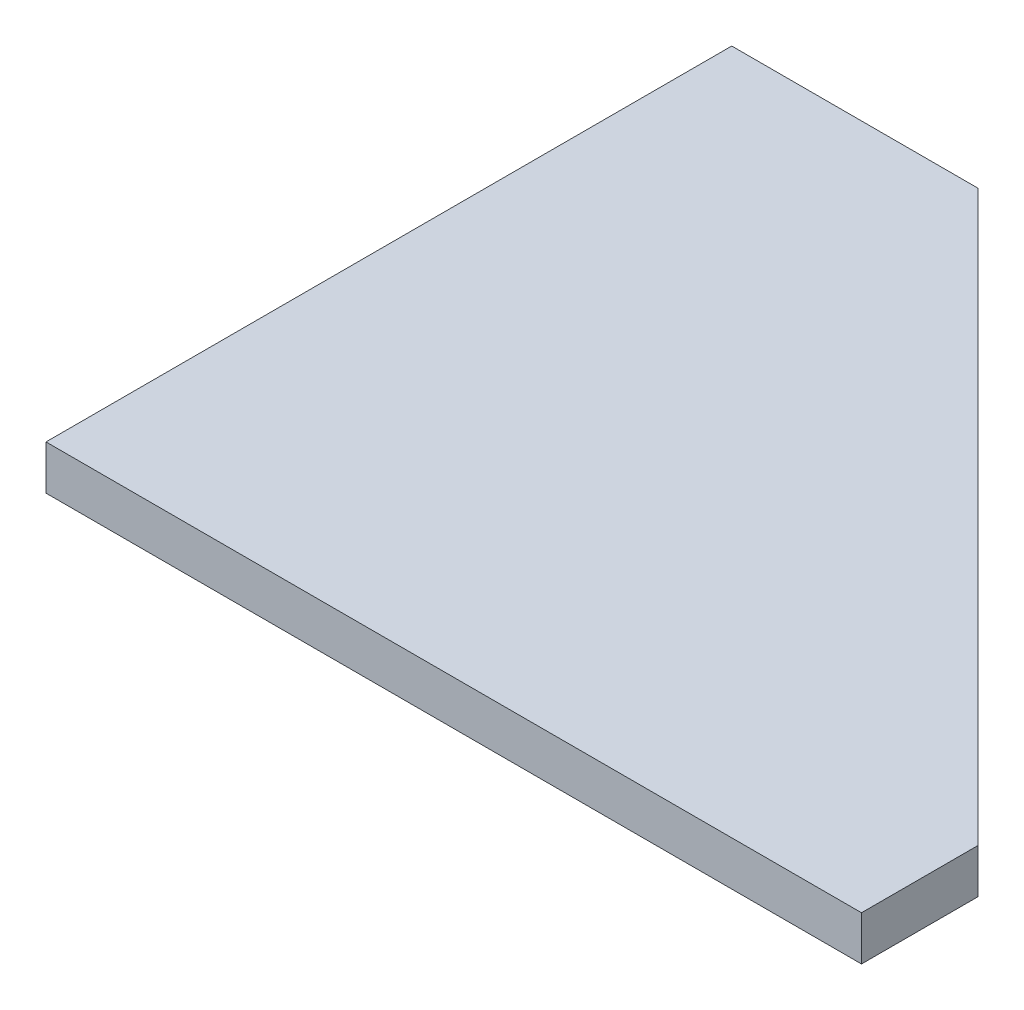
ISO-10303-21;
HEADER;
FILE_DESCRIPTION(('STEP AP214'),'2;1');
FILE_NAME('part.step','',(''),(''),'','','');
FILE_SCHEMA(('AUTOMOTIVE_DESIGN { 1 0 10303 214 1 1 1 1 }'));
ENDSEC;
DATA;
#1=APPLICATION_CONTEXT('core data for automotive mechanical design processes');
#2=APPLICATION_PROTOCOL_DEFINITION('international standard','automotive_design',2000,#1);
#3=PRODUCT_CONTEXT('',#1,'mechanical');
#4=PRODUCT('Part','Part','',(#3));
#5=PRODUCT_RELATED_PRODUCT_CATEGORY('part','',(#4));
#6=PRODUCT_DEFINITION_FORMATION('','',#4);
#7=PRODUCT_DEFINITION_CONTEXT('part definition',#1,'design');
#8=PRODUCT_DEFINITION('design','',#6,#7);
#9=PRODUCT_DEFINITION_SHAPE('','',#8);
#10=(LENGTH_UNIT() NAMED_UNIT(*) SI_UNIT(.MILLI.,.METRE.));
#11=(NAMED_UNIT(*) PLANE_ANGLE_UNIT() SI_UNIT($,.RADIAN.));
#12=(NAMED_UNIT(*) SI_UNIT($,.STERADIAN.) SOLID_ANGLE_UNIT());
#13=UNCERTAINTY_MEASURE_WITH_UNIT(LENGTH_MEASURE(1.E-05),#10,'distance_accuracy_value','');
#14=(GEOMETRIC_REPRESENTATION_CONTEXT(3) GLOBAL_UNCERTAINTY_ASSIGNED_CONTEXT((#13)) GLOBAL_UNIT_ASSIGNED_CONTEXT((#10,
#11,#12)) REPRESENTATION_CONTEXT('',''));
#15=CARTESIAN_POINT('',(0.,0.,0.));
#16=DIRECTION('',(0.,0.,1.));
#17=DIRECTION('',(1.,0.,0.));
#18=AXIS2_PLACEMENT_3D('',#15,#16,#17);
#19=CARTESIAN_POINT('',(-138.609999999998,38.1,-294.305));
#20=DIRECTION('',(-0.707106781186549,0.,0.707106781186546));
#21=DIRECTION('',(0.707106781186546,0.,0.707106781186549));
#22=AXIS2_PLACEMENT_3D('',#19,#20,#21);
#23=PLANE('',#22);
#24=DIRECTION('',(0.,-1.,0.));
#25=VECTOR('',#24,1.);
#26=CARTESIAN_POINT('',(-104.668874503045,20.,-260.363874503045));
#27=LINE('',#26,#25);
#28=CARTESIAN_POINT('',(-104.668874503045,20.,-260.363874503045));
#29=VERTEX_POINT('',#28);
#30=CARTESIAN_POINT('',(-104.668874503044,0.,-260.363874503046));
#31=VERTEX_POINT('',#30);
#32=EDGE_CURVE('E55',#29,#31,#27,.T.);
#33=ORIENTED_EDGE('',*,*,#32,.F.);
#34=DIRECTION('',(-0.707106781186532,0.,-0.707106781186563));
#35=VECTOR('',#34,1.);
#36=CARTESIAN_POINT('',(-104.668874503045,20.,-260.363874503045));
#37=LINE('',#36,#35);
#38=CARTESIAN_POINT('',(-138.609999999998,20.,-294.305));
#39=VERTEX_POINT('',#38);
#40=EDGE_CURVE('E162',#29,#39,#37,.T.);
#41=ORIENTED_EDGE('',*,*,#40,.T.);
#42=DIRECTION('',(0.,-1.,0.));
#43=VECTOR('',#42,1.);
#44=CARTESIAN_POINT('',(-138.609999999998,38.1,-294.305));
#45=LINE('',#44,#43);
#46=CARTESIAN_POINT('',(-138.609999999998,38.1,-294.305));
#47=VERTEX_POINT('',#46);
#48=EDGE_CURVE('E48',#47,#39,#45,.T.);
#49=ORIENTED_EDGE('',*,*,#48,.F.);
#50=DIRECTION('',(-0.707106781186546,0.,-0.707106781186549));
#51=VECTOR('',#50,1.);
#52=CARTESIAN_POINT('',(-138.609999999998,38.1,-294.305));
#53=LINE('',#52,#51);
#54=CARTESIAN_POINT('',(350.,38.1,194.305));
#55=VERTEX_POINT('',#54);
#56=EDGE_CURVE('E232',#55,#47,#53,.T.);
#57=ORIENTED_EDGE('',*,*,#56,.F.);
#58=DIRECTION('',(0.,-1.,0.));
#59=VECTOR('',#58,1.);
#60=CARTESIAN_POINT('',(350.,38.1,194.305));
#61=LINE('',#60,#59);
#62=CARTESIAN_POINT('',(350.,0.,194.305));
#63=VERTEX_POINT('',#62);
#64=EDGE_CURVE('E11',#55,#63,#61,.T.);
#65=ORIENTED_EDGE('',*,*,#64,.T.);
#66=DIRECTION('',(-0.707106781186546,0.,-0.707106781186549));
#67=VECTOR('',#66,1.);
#68=CARTESIAN_POINT('',(-138.609999999998,0.,-294.305));
#69=LINE('',#68,#67);
#70=EDGE_CURVE('E217',#63,#31,#69,.T.);
#71=ORIENTED_EDGE('',*,*,#70,.T.);
#72=EDGE_LOOP('',(#33,#41,#49,#57,#65,#71));
#73=FACE_BOUND('',#72,.T.);
#74=ADVANCED_FACE('F39',(#73),#23,.F.);
#75=CARTESIAN_POINT('',(0.,0.,0.));
#76=DIRECTION('',(0.,1.,0.));
#77=DIRECTION('',(0.,0.,1.));
#78=AXIS2_PLACEMENT_3D('',#75,#76,#77);
#79=PLANE('',#78);
#80=DIRECTION('',(-0.707106781186548,0.,0.707106781186548));
#81=VECTOR('',#80,1.);
#82=CARTESIAN_POINT('',(-138.609999999998,0.,-294.305));
#83=LINE('',#82,#81);
#84=CARTESIAN_POINT('',(-138.609999999998,0.,-294.305));
#85=VERTEX_POINT('',#84);
#86=CARTESIAN_POINT('',(-181.94654011792,0.,-250.968459882079));
#87=VERTEX_POINT('',#86);
#88=EDGE_CURVE('E172',#85,#87,#83,.T.);
#89=ORIENTED_EDGE('',*,*,#88,.T.);
#90=DIRECTION('',(0.718866122029623,0.,0.695148544268124));
#91=VECTOR('',#90,1.);
#92=CARTESIAN_POINT('',(-181.94654011792,0.,-250.968459882079));
#93=LINE('',#92,#91);
#94=CARTESIAN_POINT('',(-146.706941406032,0.,-216.89152261315));
#95=VERTEX_POINT('',#94);
#96=EDGE_CURVE('E325',#87,#95,#93,.T.);
#97=ORIENTED_EDGE('',*,*,#96,.T.);
#98=DIRECTION('',(0.695148544268124,0.,-0.718866122029623));
#99=VECTOR('',#98,1.);
#100=CARTESIAN_POINT('',(-146.706941406032,0.,-216.89152261315));
#101=LINE('',#100,#99);
#102=EDGE_CURVE('E184',#95,#31,#101,.T.);
#103=ORIENTED_EDGE('',*,*,#102,.T.);
#104=ORIENTED_EDGE('',*,*,#70,.F.);
#105=DIRECTION('',(0.,0.,-1.));
#106=VECTOR('',#105,1.);
#107=CARTESIAN_POINT('',(350.,0.,194.305));
#108=LINE('',#107,#106);
#109=CARTESIAN_POINT('',(350.,0.,294.305));
#110=VERTEX_POINT('',#109);
#111=EDGE_CURVE('E220',#110,#63,#108,.T.);
#112=ORIENTED_EDGE('',*,*,#111,.F.);
#113=DIRECTION('',(1.,0.,0.));
#114=VECTOR('',#113,1.);
#115=CARTESIAN_POINT('',(-350.,0.,294.305));
#116=LINE('',#115,#114);
#117=CARTESIAN_POINT('',(-350.,0.,294.305));
#118=VERTEX_POINT('',#117);
#119=EDGE_CURVE('E204',#118,#110,#116,.T.);
#120=ORIENTED_EDGE('',*,*,#119,.F.);
#121=DIRECTION('',(0.,0.,1.));
#122=VECTOR('',#121,1.);
#123=CARTESIAN_POINT('',(-350.,0.,-294.305));
#124=LINE('',#123,#122);
#125=CARTESIAN_POINT('',(-350.,0.,154.305));
#126=VERTEX_POINT('',#125);
#127=EDGE_CURVE('E213',#126,#118,#124,.T.);
#128=ORIENTED_EDGE('',*,*,#127,.F.);
#129=DIRECTION('',(-1.,0.,0.));
#130=VECTOR('',#129,1.);
#131=CARTESIAN_POINT('',(-350.,0.,154.305));
#132=LINE('',#131,#130);
#133=CARTESIAN_POINT('',(-331.,0.,154.305));
#134=VERTEX_POINT('',#133);
#135=EDGE_CURVE('E253',#134,#126,#132,.T.);
#136=ORIENTED_EDGE('',*,*,#135,.F.);
#137=DIRECTION('',(0.,0.,1.));
#138=VECTOR('',#137,1.);
#139=CARTESIAN_POINT('',(-331.,0.,104.305));
#140=LINE('',#139,#138);
#141=CARTESIAN_POINT('',(-331.,0.,104.305));
#142=VERTEX_POINT('',#141);
#143=EDGE_CURVE('E257',#142,#134,#140,.T.);
#144=ORIENTED_EDGE('',*,*,#143,.F.);
#145=DIRECTION('',(1.,0.,0.));
#146=VECTOR('',#145,1.);
#147=CARTESIAN_POINT('',(-350.,0.,104.305));
#148=LINE('',#147,#146);
#149=CARTESIAN_POINT('',(-350.,0.,104.305));
#150=VERTEX_POINT('',#149);
#151=EDGE_CURVE('E63',#150,#142,#148,.T.);
#152=ORIENTED_EDGE('',*,*,#151,.F.);
#153=CARTESIAN_POINT('',(-350.,0.,-104.305));
#154=VERTEX_POINT('',#153);
#155=EDGE_CURVE('E212',#154,#150,#124,.T.);
#156=ORIENTED_EDGE('',*,*,#155,.F.);
#157=DIRECTION('',(-1.,0.,0.));
#158=VECTOR('',#157,1.);
#159=CARTESIAN_POINT('',(-350.,0.,-104.305));
#160=LINE('',#159,#158);
#161=CARTESIAN_POINT('',(-331.,0.,-104.305));
#162=VERTEX_POINT('',#161);
#163=EDGE_CURVE('E290',#162,#154,#160,.T.);
#164=ORIENTED_EDGE('',*,*,#163,.F.);
#165=DIRECTION('',(0.,0.,1.));
#166=VECTOR('',#165,1.);
#167=CARTESIAN_POINT('',(-331.,0.,-104.305));
#168=LINE('',#167,#166);
#169=CARTESIAN_POINT('',(-331.,0.,-154.305));
#170=VERTEX_POINT('',#169);
#171=EDGE_CURVE('E294',#170,#162,#168,.T.);
#172=ORIENTED_EDGE('',*,*,#171,.F.);
#173=DIRECTION('',(1.,0.,0.));
#174=VECTOR('',#173,1.);
#175=CARTESIAN_POINT('',(-350.,0.,-154.305));
#176=LINE('',#175,#174);
#177=CARTESIAN_POINT('',(-350.,0.,-154.305));
#178=VERTEX_POINT('',#177);
#179=EDGE_CURVE('E252',#178,#170,#176,.T.);
#180=ORIENTED_EDGE('',*,*,#179,.F.);
#181=CARTESIAN_POINT('',(-350.,0.,-294.305));
#182=VERTEX_POINT('',#181);
#183=EDGE_CURVE('E208',#182,#178,#124,.T.);
#184=ORIENTED_EDGE('',*,*,#183,.F.);
#185=DIRECTION('',(-1.,0.,0.));
#186=VECTOR('',#185,1.);
#187=CARTESIAN_POINT('',(-350.,0.,-294.305));
#188=LINE('',#187,#186);
#189=EDGE_CURVE('E214',#85,#182,#188,.T.);
#190=ORIENTED_EDGE('',*,*,#189,.F.);
#191=EDGE_LOOP('',(#89,#97,#103,#104,#112,#120,#128,#136,#144,#152,#156,#164,#172,#180,#184,#190));
#192=FACE_BOUND('',#191,.T.);
#193=ADVANCED_FACE('F340',(#192),#79,.F.);
#194=CARTESIAN_POINT('',(350.,38.1,194.305));
#195=DIRECTION('',(-1.,0.,0.));
#196=DIRECTION('',(0.,0.,1.));
#197=AXIS2_PLACEMENT_3D('',#194,#195,#196);
#198=PLANE('',#197);
#199=ORIENTED_EDGE('',*,*,#111,.T.);
#200=ORIENTED_EDGE('',*,*,#64,.F.);
#201=DIRECTION('',(0.,0.,-1.));
#202=VECTOR('',#201,1.);
#203=CARTESIAN_POINT('',(350.,38.1,194.305));
#204=LINE('',#203,#202);
#205=CARTESIAN_POINT('',(350.,38.1,294.305));
#206=VERTEX_POINT('',#205);
#207=EDGE_CURVE('E207',#206,#55,#204,.T.);
#208=ORIENTED_EDGE('',*,*,#207,.F.);
#209=DIRECTION('',(0.,-1.,0.));
#210=VECTOR('',#209,1.);
#211=CARTESIAN_POINT('',(350.,38.1,294.305));
#212=LINE('',#211,#210);
#213=EDGE_CURVE('E199',#206,#110,#212,.T.);
#214=ORIENTED_EDGE('',*,*,#213,.T.);
#215=EDGE_LOOP('',(#199,#200,#208,#214));
#216=FACE_BOUND('',#215,.T.);
#217=ADVANCED_FACE('F41',(#216),#198,.F.);
#218=CARTESIAN_POINT('',(-350.,38.1,-294.305));
#219=DIRECTION('',(0.,0.,1.));
#220=DIRECTION('',(1.,0.,0.));
#221=AXIS2_PLACEMENT_3D('',#218,#219,#220);
#222=PLANE('',#221);
#223=ORIENTED_EDGE('',*,*,#189,.T.);
#224=DIRECTION('',(0.,-1.,0.));
#225=VECTOR('',#224,1.);
#226=CARTESIAN_POINT('',(-350.,38.1,-294.305));
#227=LINE('',#226,#225);
#228=CARTESIAN_POINT('',(-350.,38.1,-294.305));
#229=VERTEX_POINT('',#228);
#230=EDGE_CURVE('E190',#229,#182,#227,.T.);
#231=ORIENTED_EDGE('',*,*,#230,.F.);
#232=DIRECTION('',(-1.,0.,0.));
#233=VECTOR('',#232,1.);
#234=CARTESIAN_POINT('',(-350.,38.1,-294.305));
#235=LINE('',#234,#233);
#236=EDGE_CURVE('E188',#47,#229,#235,.T.);
#237=ORIENTED_EDGE('',*,*,#236,.F.);
#238=ORIENTED_EDGE('',*,*,#48,.T.);
#239=DIRECTION('',(0.,-1.,0.));
#240=VECTOR('',#239,1.);
#241=CARTESIAN_POINT('',(-138.609999999998,20.,-294.305));
#242=LINE('',#241,#240);
#243=EDGE_CURVE('E169',#39,#85,#242,.T.);
#244=ORIENTED_EDGE('',*,*,#243,.T.);
#245=EDGE_LOOP('',(#223,#231,#237,#238,#244));
#246=FACE_BOUND('',#245,.T.);
#247=ADVANCED_FACE('F186',(#246),#222,.F.);
#248=CARTESIAN_POINT('',(-350.,38.1,-294.305));
#249=DIRECTION('',(1.,0.,0.));
#250=DIRECTION('',(0.,0.,-1.));
#251=AXIS2_PLACEMENT_3D('',#248,#249,#250);
#252=PLANE('',#251);
#253=DIRECTION('',(0.,0.,-1.));
#254=VECTOR('',#253,1.);
#255=CARTESIAN_POINT('',(-350.,2.,-104.305));
#256=LINE('',#255,#254);
#257=CARTESIAN_POINT('',(-350.,2.,-104.305));
#258=VERTEX_POINT('',#257);
#259=CARTESIAN_POINT('',(-350.,2.,-154.305));
#260=VERTEX_POINT('',#259);
#261=EDGE_CURVE('E293',#258,#260,#256,.T.);
#262=ORIENTED_EDGE('',*,*,#261,.F.);
#263=DIRECTION('',(0.,-1.,0.));
#264=VECTOR('',#263,1.);
#265=CARTESIAN_POINT('',(-350.,2.,-104.305));
#266=LINE('',#265,#264);
#267=EDGE_CURVE('E224',#258,#154,#266,.T.);
#268=ORIENTED_EDGE('',*,*,#267,.T.);
#269=ORIENTED_EDGE('',*,*,#155,.T.);
#270=DIRECTION('',(0.,-1.,0.));
#271=VECTOR('',#270,1.);
#272=CARTESIAN_POINT('',(-350.,2.,104.305));
#273=LINE('',#272,#271);
#274=CARTESIAN_POINT('',(-350.,2.,104.305));
#275=VERTEX_POINT('',#274);
#276=EDGE_CURVE('E249',#275,#150,#273,.T.);
#277=ORIENTED_EDGE('',*,*,#276,.F.);
#278=DIRECTION('',(0.,0.,-1.));
#279=VECTOR('',#278,1.);
#280=CARTESIAN_POINT('',(-350.,2.,104.305));
#281=LINE('',#280,#279);
#282=CARTESIAN_POINT('',(-350.,2.,154.305));
#283=VERTEX_POINT('',#282);
#284=EDGE_CURVE('E242',#283,#275,#281,.T.);
#285=ORIENTED_EDGE('',*,*,#284,.F.);
#286=DIRECTION('',(0.,-1.,0.));
#287=VECTOR('',#286,1.);
#288=CARTESIAN_POINT('',(-350.,2.,154.305));
#289=LINE('',#288,#287);
#290=EDGE_CURVE('E245',#283,#126,#289,.T.);
#291=ORIENTED_EDGE('',*,*,#290,.T.);
#292=ORIENTED_EDGE('',*,*,#127,.T.);
#293=DIRECTION('',(0.,-1.,0.));
#294=VECTOR('',#293,1.);
#295=CARTESIAN_POINT('',(-350.,38.1,294.305));
#296=LINE('',#295,#294);
#297=CARTESIAN_POINT('',(-350.,38.1,294.305));
#298=VERTEX_POINT('',#297);
#299=EDGE_CURVE('E193',#298,#118,#296,.T.);
#300=ORIENTED_EDGE('',*,*,#299,.F.);
#301=DIRECTION('',(0.,0.,1.));
#302=VECTOR('',#301,1.);
#303=CARTESIAN_POINT('',(-350.,38.1,-294.305));
#304=LINE('',#303,#302);
#305=EDGE_CURVE('E227',#229,#298,#304,.T.);
#306=ORIENTED_EDGE('',*,*,#305,.F.);
#307=ORIENTED_EDGE('',*,*,#230,.T.);
#308=ORIENTED_EDGE('',*,*,#183,.T.);
#309=DIRECTION('',(0.,-1.,0.));
#310=VECTOR('',#309,1.);
#311=CARTESIAN_POINT('',(-350.,2.,-154.305));
#312=LINE('',#311,#310);
#313=EDGE_CURVE('E277',#260,#178,#312,.T.);
#314=ORIENTED_EDGE('',*,*,#313,.F.);
#315=EDGE_LOOP('',(#262,#268,#269,#277,#285,#291,#292,#300,#306,#307,#308,#314));
#316=FACE_BOUND('',#315,.T.);
#317=ADVANCED_FACE('F346',(#316),#252,.F.);
#318=CARTESIAN_POINT('',(-350.,38.1,294.305));
#319=DIRECTION('',(0.,0.,-1.));
#320=DIRECTION('',(-1.,0.,0.));
#321=AXIS2_PLACEMENT_3D('',#318,#319,#320);
#322=PLANE('',#321);
#323=ORIENTED_EDGE('',*,*,#119,.T.);
#324=ORIENTED_EDGE('',*,*,#213,.F.);
#325=DIRECTION('',(1.,0.,0.));
#326=VECTOR('',#325,1.);
#327=CARTESIAN_POINT('',(-350.,38.1,294.305));
#328=LINE('',#327,#326);
#329=EDGE_CURVE('E203',#298,#206,#328,.T.);
#330=ORIENTED_EDGE('',*,*,#329,.F.);
#331=ORIENTED_EDGE('',*,*,#299,.T.);
#332=EDGE_LOOP('',(#323,#324,#330,#331));
#333=FACE_BOUND('',#332,.T.);
#334=ADVANCED_FACE('F361',(#333),#322,.F.);
#335=CARTESIAN_POINT('',(0.,38.1,0.));
#336=DIRECTION('',(0.,1.,0.));
#337=DIRECTION('',(0.,0.,1.));
#338=AXIS2_PLACEMENT_3D('',#335,#336,#337);
#339=PLANE('',#338);
#340=ORIENTED_EDGE('',*,*,#207,.T.);
#341=ORIENTED_EDGE('',*,*,#56,.T.);
#342=ORIENTED_EDGE('',*,*,#236,.T.);
#343=ORIENTED_EDGE('',*,*,#305,.T.);
#344=ORIENTED_EDGE('',*,*,#329,.T.);
#345=EDGE_LOOP('',(#340,#341,#342,#343,#344));
#346=FACE_BOUND('',#345,.T.);
#347=ADVANCED_FACE('F351',(#346),#339,.T.);
#348=CARTESIAN_POINT('',(-350.,2.,104.305));
#349=DIRECTION('',(0.,0.,-1.));
#350=DIRECTION('',(-1.,0.,0.));
#351=AXIS2_PLACEMENT_3D('',#348,#349,#350);
#352=PLANE('',#351);
#353=ORIENTED_EDGE('',*,*,#151,.T.);
#354=DIRECTION('',(0.,-1.,0.));
#355=VECTOR('',#354,1.);
#356=CARTESIAN_POINT('',(-331.,2.,104.305));
#357=LINE('',#356,#355);
#358=CARTESIAN_POINT('',(-331.,2.,104.305));
#359=VERTEX_POINT('',#358);
#360=EDGE_CURVE('E238',#359,#142,#357,.T.);
#361=ORIENTED_EDGE('',*,*,#360,.F.);
#362=DIRECTION('',(1.,0.,0.));
#363=VECTOR('',#362,1.);
#364=CARTESIAN_POINT('',(-350.,2.,104.305));
#365=LINE('',#364,#363);
#366=EDGE_CURVE('E256',#275,#359,#365,.T.);
#367=ORIENTED_EDGE('',*,*,#366,.F.);
#368=ORIENTED_EDGE('',*,*,#276,.T.);
#369=EDGE_LOOP('',(#353,#361,#367,#368));
#370=FACE_BOUND('',#369,.T.);
#371=ADVANCED_FACE('F368',(#370),#352,.F.);
#372=CARTESIAN_POINT('',(-350.,2.,154.305));
#373=DIRECTION('',(0.,0.,1.));
#374=DIRECTION('',(1.,0.,0.));
#375=AXIS2_PLACEMENT_3D('',#372,#373,#374);
#376=PLANE('',#375);
#377=ORIENTED_EDGE('',*,*,#135,.T.);
#378=ORIENTED_EDGE('',*,*,#290,.F.);
#379=DIRECTION('',(-1.,0.,0.));
#380=VECTOR('',#379,1.);
#381=CARTESIAN_POINT('',(-350.,2.,154.305));
#382=LINE('',#381,#380);
#383=CARTESIAN_POINT('',(-331.,2.,154.305));
#384=VERTEX_POINT('',#383);
#385=EDGE_CURVE('E266',#384,#283,#382,.T.);
#386=ORIENTED_EDGE('',*,*,#385,.F.);
#387=DIRECTION('',(0.,-1.,0.));
#388=VECTOR('',#387,1.);
#389=CARTESIAN_POINT('',(-331.,2.,154.305));
#390=LINE('',#389,#388);
#391=EDGE_CURVE('E241',#384,#134,#390,.T.);
#392=ORIENTED_EDGE('',*,*,#391,.T.);
#393=EDGE_LOOP('',(#377,#378,#386,#392));
#394=FACE_BOUND('',#393,.T.);
#395=ADVANCED_FACE('F454',(#394),#376,.F.);
#396=CARTESIAN_POINT('',(-331.,2.,104.305));
#397=DIRECTION('',(1.,0.,0.));
#398=DIRECTION('',(0.,0.,-1.));
#399=AXIS2_PLACEMENT_3D('',#396,#397,#398);
#400=PLANE('',#399);
#401=ORIENTED_EDGE('',*,*,#143,.T.);
#402=ORIENTED_EDGE('',*,*,#391,.F.);
#403=DIRECTION('',(0.,0.,1.));
#404=VECTOR('',#403,1.);
#405=CARTESIAN_POINT('',(-331.,2.,104.305));
#406=LINE('',#405,#404);
#407=EDGE_CURVE('E270',#359,#384,#406,.T.);
#408=ORIENTED_EDGE('',*,*,#407,.F.);
#409=ORIENTED_EDGE('',*,*,#360,.T.);
#410=EDGE_LOOP('',(#401,#402,#408,#409));
#411=FACE_BOUND('',#410,.T.);
#412=ADVANCED_FACE('F452',(#411),#400,.F.);
#413=CARTESIAN_POINT('',(0.,2.,0.));
#414=DIRECTION('',(0.,-1.,0.));
#415=DIRECTION('',(0.,0.,-1.));
#416=AXIS2_PLACEMENT_3D('',#413,#414,#415);
#417=PLANE('',#416);
#418=ORIENTED_EDGE('',*,*,#366,.T.);
#419=ORIENTED_EDGE('',*,*,#407,.T.);
#420=ORIENTED_EDGE('',*,*,#385,.T.);
#421=ORIENTED_EDGE('',*,*,#284,.T.);
#422=EDGE_LOOP('',(#418,#419,#420,#421));
#423=FACE_BOUND('',#422,.T.);
#424=ADVANCED_FACE('F442',(#423),#417,.T.);
#425=CARTESIAN_POINT('',(-350.,2.,-104.305));
#426=DIRECTION('',(0.,0.,1.));
#427=DIRECTION('',(1.,0.,0.));
#428=AXIS2_PLACEMENT_3D('',#425,#426,#427);
#429=PLANE('',#428);
#430=ORIENTED_EDGE('',*,*,#163,.T.);
#431=ORIENTED_EDGE('',*,*,#267,.F.);
#432=DIRECTION('',(-1.,0.,0.));
#433=VECTOR('',#432,1.);
#434=CARTESIAN_POINT('',(-350.,2.,-104.305));
#435=LINE('',#434,#433);
#436=CARTESIAN_POINT('',(-331.,2.,-104.305));
#437=VERTEX_POINT('',#436);
#438=EDGE_CURVE('E281',#437,#258,#435,.T.);
#439=ORIENTED_EDGE('',*,*,#438,.F.);
#440=DIRECTION('',(0.,-1.,0.));
#441=VECTOR('',#440,1.);
#442=CARTESIAN_POINT('',(-331.,2.,-104.305));
#443=LINE('',#442,#441);
#444=EDGE_CURVE('E284',#437,#162,#443,.T.);
#445=ORIENTED_EDGE('',*,*,#444,.T.);
#446=EDGE_LOOP('',(#430,#431,#439,#445));
#447=FACE_BOUND('',#446,.T.);
#448=ADVANCED_FACE('F438',(#447),#429,.F.);
#449=CARTESIAN_POINT('',(-331.,2.,-104.305));
#450=DIRECTION('',(1.,0.,0.));
#451=DIRECTION('',(0.,0.,-1.));
#452=AXIS2_PLACEMENT_3D('',#449,#450,#451);
#453=PLANE('',#452);
#454=ORIENTED_EDGE('',*,*,#171,.T.);
#455=ORIENTED_EDGE('',*,*,#444,.F.);
#456=DIRECTION('',(0.,0.,1.));
#457=VECTOR('',#456,1.);
#458=CARTESIAN_POINT('',(-331.,2.,-104.305));
#459=LINE('',#458,#457);
#460=CARTESIAN_POINT('',(-331.,2.,-154.305));
#461=VERTEX_POINT('',#460);
#462=EDGE_CURVE('E304',#461,#437,#459,.T.);
#463=ORIENTED_EDGE('',*,*,#462,.F.);
#464=DIRECTION('',(0.,-1.,0.));
#465=VECTOR('',#464,1.);
#466=CARTESIAN_POINT('',(-331.,2.,-154.305));
#467=LINE('',#466,#465);
#468=EDGE_CURVE('E280',#461,#170,#467,.T.);
#469=ORIENTED_EDGE('',*,*,#468,.T.);
#470=EDGE_LOOP('',(#454,#455,#463,#469));
#471=FACE_BOUND('',#470,.T.);
#472=ADVANCED_FACE('F441',(#471),#453,.F.);
#473=CARTESIAN_POINT('',(-350.,2.,-154.305));
#474=DIRECTION('',(0.,0.,-1.));
#475=DIRECTION('',(-1.,0.,0.));
#476=AXIS2_PLACEMENT_3D('',#473,#474,#475);
#477=PLANE('',#476);
#478=ORIENTED_EDGE('',*,*,#179,.T.);
#479=ORIENTED_EDGE('',*,*,#468,.F.);
#480=DIRECTION('',(1.,0.,0.));
#481=VECTOR('',#480,1.);
#482=CARTESIAN_POINT('',(-350.,2.,-154.305));
#483=LINE('',#482,#481);
#484=EDGE_CURVE('E308',#260,#461,#483,.T.);
#485=ORIENTED_EDGE('',*,*,#484,.F.);
#486=ORIENTED_EDGE('',*,*,#313,.T.);
#487=EDGE_LOOP('',(#478,#479,#485,#486));
#488=FACE_BOUND('',#487,.T.);
#489=ADVANCED_FACE('F436',(#488),#477,.F.);
#490=CARTESIAN_POINT('',(0.,2.,0.));
#491=DIRECTION('',(0.,-1.,0.));
#492=DIRECTION('',(0.,0.,-1.));
#493=AXIS2_PLACEMENT_3D('',#490,#491,#492);
#494=PLANE('',#493);
#495=ORIENTED_EDGE('',*,*,#261,.T.);
#496=ORIENTED_EDGE('',*,*,#484,.T.);
#497=ORIENTED_EDGE('',*,*,#462,.T.);
#498=ORIENTED_EDGE('',*,*,#438,.T.);
#499=EDGE_LOOP('',(#495,#496,#497,#498));
#500=FACE_BOUND('',#499,.T.);
#501=ADVANCED_FACE('F405',(#500),#494,.T.);
#502=CARTESIAN_POINT('',(-138.609999999998,20.,-294.305));
#503=DIRECTION('',(0.707106781186548,0.,0.707106781186548));
#504=DIRECTION('',(0.707106781186548,0.,-0.707106781186548));
#505=AXIS2_PLACEMENT_3D('',#502,#503,#504);
#506=PLANE('',#505);
#507=ORIENTED_EDGE('',*,*,#88,.F.);
#508=ORIENTED_EDGE('',*,*,#243,.F.);
#509=DIRECTION('',(-0.707106781186548,0.,0.707106781186548));
#510=VECTOR('',#509,1.);
#511=CARTESIAN_POINT('',(-138.609999999998,20.,-294.305));
#512=LINE('',#511,#510);
#513=CARTESIAN_POINT('',(-181.94654011792,20.,-250.968459882079));
#514=VERTEX_POINT('',#513);
#515=EDGE_CURVE('E157',#39,#514,#512,.T.);
#516=ORIENTED_EDGE('',*,*,#515,.T.);
#517=DIRECTION('',(0.,-1.,0.));
#518=VECTOR('',#517,1.);
#519=CARTESIAN_POINT('',(-181.94654011792,20.,-250.968459882079));
#520=LINE('',#519,#518);
#521=EDGE_CURVE('E177',#514,#87,#520,.T.);
#522=ORIENTED_EDGE('',*,*,#521,.T.);
#523=EDGE_LOOP('',(#507,#508,#516,#522));
#524=FACE_BOUND('',#523,.T.);
#525=ADVANCED_FACE('F170',(#524),#506,.T.);
#526=CARTESIAN_POINT('',(-181.94654011792,20.,-250.968459882079));
#527=DIRECTION('',(0.695148544268124,0.,-0.718866122029623));
#528=DIRECTION('',(-0.718866122029623,0.,-0.695148544268124));
#529=AXIS2_PLACEMENT_3D('',#526,#527,#528);
#530=PLANE('',#529);
#531=ORIENTED_EDGE('',*,*,#96,.F.);
#532=ORIENTED_EDGE('',*,*,#521,.F.);
#533=DIRECTION('',(0.718866122029623,0.,0.695148544268124));
#534=VECTOR('',#533,1.);
#535=CARTESIAN_POINT('',(-181.94654011792,20.,-250.968459882079));
#536=LINE('',#535,#534);
#537=CARTESIAN_POINT('',(-146.706941406032,20.,-216.89152261315));
#538=VERTEX_POINT('',#537);
#539=EDGE_CURVE('E163',#514,#538,#536,.T.);
#540=ORIENTED_EDGE('',*,*,#539,.T.);
#541=DIRECTION('',(0.,-1.,0.));
#542=VECTOR('',#541,1.);
#543=CARTESIAN_POINT('',(-146.706941406032,20.,-216.89152261315));
#544=LINE('',#543,#542);
#545=EDGE_CURVE('E317',#538,#95,#544,.T.);
#546=ORIENTED_EDGE('',*,*,#545,.T.);
#547=EDGE_LOOP('',(#531,#532,#540,#546));
#548=FACE_BOUND('',#547,.T.);
#549=ADVANCED_FACE('F337',(#548),#530,.T.);
#550=CARTESIAN_POINT('',(-146.706941406032,20.,-216.89152261315));
#551=DIRECTION('',(-0.718866122029623,0.,-0.695148544268124));
#552=DIRECTION('',(-0.695148544268124,0.,0.718866122029623));
#553=AXIS2_PLACEMENT_3D('',#550,#551,#552);
#554=PLANE('',#553);
#555=ORIENTED_EDGE('',*,*,#102,.F.);
#556=ORIENTED_EDGE('',*,*,#545,.F.);
#557=DIRECTION('',(0.695148544268124,0.,-0.718866122029623));
#558=VECTOR('',#557,1.);
#559=CARTESIAN_POINT('',(-146.706941406032,20.,-216.89152261315));
#560=LINE('',#559,#558);
#561=EDGE_CURVE('E322',#538,#29,#560,.T.);
#562=ORIENTED_EDGE('',*,*,#561,.T.);
#563=ORIENTED_EDGE('',*,*,#32,.T.);
#564=EDGE_LOOP('',(#555,#556,#562,#563));
#565=FACE_BOUND('',#564,.T.);
#566=ADVANCED_FACE('F338',(#565),#554,.T.);
#567=CARTESIAN_POINT('',(0.,20.,0.));
#568=DIRECTION('',(0.,1.,0.));
#569=DIRECTION('',(0.,0.,1.));
#570=AXIS2_PLACEMENT_3D('',#567,#568,#569);
#571=PLANE('',#570);
#572=ORIENTED_EDGE('',*,*,#40,.F.);
#573=ORIENTED_EDGE('',*,*,#561,.F.);
#574=ORIENTED_EDGE('',*,*,#539,.F.);
#575=ORIENTED_EDGE('',*,*,#515,.F.);
#576=EDGE_LOOP('',(#572,#573,#574,#575));
#577=FACE_BOUND('',#576,.T.);
#578=ADVANCED_FACE('F159',(#577),#571,.F.);
#579=CLOSED_SHELL('',(#74,#193,#217,#247,#317,#334,#347,#371,#395,#412,#424,#448,#472,#489,#501,
#525,#549,#566,#578));
#580=MANIFOLD_SOLID_BREP('B2',#579);
#581=ADVANCED_BREP_SHAPE_REPRESENTATION('',(#18,#580),#14);
#582=SHAPE_DEFINITION_REPRESENTATION(#9,#581);
ENDSEC;
END-ISO-10303-21;
